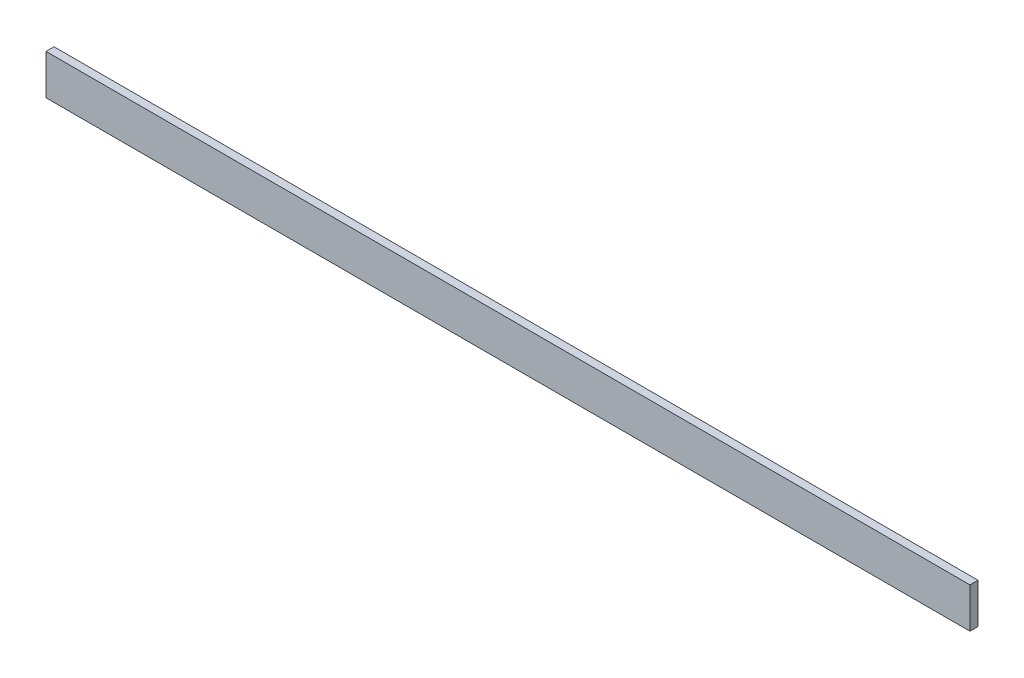
ISO-10303-21;
HEADER;
FILE_DESCRIPTION(('STEP AP214'),'2;1');
FILE_NAME('part.step','',(''),(''),'','','');
FILE_SCHEMA(('AUTOMOTIVE_DESIGN { 1 0 10303 214 1 1 1 1 }'));
ENDSEC;
DATA;
#1=APPLICATION_CONTEXT('core data for automotive mechanical design processes');
#2=APPLICATION_PROTOCOL_DEFINITION('international standard','automotive_design',2000,#1);
#3=PRODUCT_CONTEXT('',#1,'mechanical');
#4=PRODUCT('Part','Part','',(#3));
#5=PRODUCT_RELATED_PRODUCT_CATEGORY('part','',(#4));
#6=PRODUCT_DEFINITION_FORMATION('','',#4);
#7=PRODUCT_DEFINITION_CONTEXT('part definition',#1,'design');
#8=PRODUCT_DEFINITION('design','',#6,#7);
#9=PRODUCT_DEFINITION_SHAPE('','',#8);
#10=(LENGTH_UNIT() NAMED_UNIT(*) SI_UNIT(.MILLI.,.METRE.));
#11=(NAMED_UNIT(*) PLANE_ANGLE_UNIT() SI_UNIT($,.RADIAN.));
#12=(NAMED_UNIT(*) SI_UNIT($,.STERADIAN.) SOLID_ANGLE_UNIT());
#13=UNCERTAINTY_MEASURE_WITH_UNIT(LENGTH_MEASURE(1.E-05),#10,'distance_accuracy_value','');
#14=(GEOMETRIC_REPRESENTATION_CONTEXT(3) GLOBAL_UNCERTAINTY_ASSIGNED_CONTEXT((#13)) GLOBAL_UNIT_ASSIGNED_CONTEXT((#10,
#11,#12)) REPRESENTATION_CONTEXT('',''));
#15=CARTESIAN_POINT('',(0.,0.,0.));
#16=DIRECTION('',(0.,0.,1.));
#17=DIRECTION('',(1.,0.,0.));
#18=AXIS2_PLACEMENT_3D('',#15,#16,#17);
#19=CARTESIAN_POINT('',(0.,0.,20.));
#20=DIRECTION('',(1.,0.,0.));
#21=DIRECTION('',(0.,0.,-1.));
#22=AXIS2_PLACEMENT_3D('',#19,#20,#21);
#23=PLANE('',#22);
#24=DIRECTION('',(0.,-1.,0.));
#25=VECTOR('',#24,1.);
#26=CARTESIAN_POINT('',(0.,0.,0.));
#27=LINE('',#26,#25);
#28=CARTESIAN_POINT('',(0.,100.,0.));
#29=VERTEX_POINT('',#28);
#30=CARTESIAN_POINT('',(0.,0.,0.));
#31=VERTEX_POINT('',#30);
#32=EDGE_CURVE('E107',#29,#31,#27,.T.);
#33=ORIENTED_EDGE('',*,*,#32,.T.);
#34=DIRECTION('',(0.,0.,-1.));
#35=VECTOR('',#34,1.);
#36=CARTESIAN_POINT('',(0.,0.,20.));
#37=LINE('',#36,#35);
#38=CARTESIAN_POINT('',(0.,0.,20.));
#39=VERTEX_POINT('',#38);
#40=EDGE_CURVE('E11',#39,#31,#37,.T.);
#41=ORIENTED_EDGE('',*,*,#40,.F.);
#42=DIRECTION('',(0.,-1.,0.));
#43=VECTOR('',#42,1.);
#44=CARTESIAN_POINT('',(0.,0.,20.));
#45=LINE('',#44,#43);
#46=CARTESIAN_POINT('',(0.,100.,20.));
#47=VERTEX_POINT('',#46);
#48=EDGE_CURVE('E91',#47,#39,#45,.T.);
#49=ORIENTED_EDGE('',*,*,#48,.F.);
#50=DIRECTION('',(0.,0.,-1.));
#51=VECTOR('',#50,1.);
#52=CARTESIAN_POINT('',(0.,100.,20.));
#53=LINE('',#52,#51);
#54=EDGE_CURVE('E103',#47,#29,#53,.T.);
#55=ORIENTED_EDGE('',*,*,#54,.T.);
#56=EDGE_LOOP('',(#33,#41,#49,#55));
#57=FACE_BOUND('',#56,.T.);
#58=ADVANCED_FACE('F39',(#57),#23,.F.);
#59=CARTESIAN_POINT('',(0.,0.,20.));
#60=DIRECTION('',(0.,1.,0.));
#61=DIRECTION('',(0.,0.,1.));
#62=AXIS2_PLACEMENT_3D('',#59,#60,#61);
#63=PLANE('',#62);
#64=DIRECTION('',(1.,0.,0.));
#65=VECTOR('',#64,1.);
#66=CARTESIAN_POINT('',(0.,0.,0.));
#67=LINE('',#66,#65);
#68=CARTESIAN_POINT('',(2300.,0.,0.));
#69=VERTEX_POINT('',#68);
#70=EDGE_CURVE('E96',#31,#69,#67,.T.);
#71=ORIENTED_EDGE('',*,*,#70,.T.);
#72=DIRECTION('',(0.,0.,-1.));
#73=VECTOR('',#72,1.);
#74=CARTESIAN_POINT('',(2300.,0.,20.));
#75=LINE('',#74,#73);
#76=CARTESIAN_POINT('',(2300.,0.,20.));
#77=VERTEX_POINT('',#76);
#78=EDGE_CURVE('E48',#77,#69,#75,.T.);
#79=ORIENTED_EDGE('',*,*,#78,.F.);
#80=DIRECTION('',(1.,0.,0.));
#81=VECTOR('',#80,1.);
#82=CARTESIAN_POINT('',(0.,0.,20.));
#83=LINE('',#82,#81);
#84=EDGE_CURVE('E86',#39,#77,#83,.T.);
#85=ORIENTED_EDGE('',*,*,#84,.F.);
#86=ORIENTED_EDGE('',*,*,#40,.T.);
#87=EDGE_LOOP('',(#71,#79,#85,#86));
#88=FACE_BOUND('',#87,.T.);
#89=ADVANCED_FACE('F95',(#88),#63,.F.);
#90=CARTESIAN_POINT('',(2300.,0.,20.));
#91=DIRECTION('',(-1.,0.,0.));
#92=DIRECTION('',(0.,0.,1.));
#93=AXIS2_PLACEMENT_3D('',#90,#91,#92);
#94=PLANE('',#93);
#95=DIRECTION('',(0.,1.,0.));
#96=VECTOR('',#95,1.);
#97=CARTESIAN_POINT('',(2300.,0.,0.));
#98=LINE('',#97,#96);
#99=CARTESIAN_POINT('',(2300.,100.,0.));
#100=VERTEX_POINT('',#99);
#101=EDGE_CURVE('E73',#69,#100,#98,.T.);
#102=ORIENTED_EDGE('',*,*,#101,.T.);
#103=DIRECTION('',(0.,0.,-1.));
#104=VECTOR('',#103,1.);
#105=CARTESIAN_POINT('',(2300.,100.,20.));
#106=LINE('',#105,#104);
#107=CARTESIAN_POINT('',(2300.,100.,20.));
#108=VERTEX_POINT('',#107);
#109=EDGE_CURVE('E98',#108,#100,#106,.T.);
#110=ORIENTED_EDGE('',*,*,#109,.F.);
#111=DIRECTION('',(0.,1.,0.));
#112=VECTOR('',#111,1.);
#113=CARTESIAN_POINT('',(2300.,0.,20.));
#114=LINE('',#113,#112);
#115=EDGE_CURVE('E89',#77,#108,#114,.T.);
#116=ORIENTED_EDGE('',*,*,#115,.F.);
#117=ORIENTED_EDGE('',*,*,#78,.T.);
#118=EDGE_LOOP('',(#102,#110,#116,#117));
#119=FACE_BOUND('',#118,.T.);
#120=ADVANCED_FACE('F99',(#119),#94,.F.);
#121=CARTESIAN_POINT('',(0.,100.,20.));
#122=DIRECTION('',(0.,-1.,0.));
#123=DIRECTION('',(0.,0.,-1.));
#124=AXIS2_PLACEMENT_3D('',#121,#122,#123);
#125=PLANE('',#124);
#126=DIRECTION('',(-1.,0.,0.));
#127=VECTOR('',#126,1.);
#128=CARTESIAN_POINT('',(0.,100.,0.));
#129=LINE('',#128,#127);
#130=EDGE_CURVE('E79',#100,#29,#129,.T.);
#131=ORIENTED_EDGE('',*,*,#130,.T.);
#132=ORIENTED_EDGE('',*,*,#54,.F.);
#133=DIRECTION('',(-1.,0.,0.));
#134=VECTOR('',#133,1.);
#135=CARTESIAN_POINT('',(0.,100.,20.));
#136=LINE('',#135,#134);
#137=EDGE_CURVE('E56',#108,#47,#136,.T.);
#138=ORIENTED_EDGE('',*,*,#137,.F.);
#139=ORIENTED_EDGE('',*,*,#109,.T.);
#140=EDGE_LOOP('',(#131,#132,#138,#139));
#141=FACE_BOUND('',#140,.T.);
#142=ADVANCED_FACE('F120',(#141),#125,.F.);
#143=CARTESIAN_POINT('',(0.,0.,20.));
#144=DIRECTION('',(0.,0.,-1.));
#145=DIRECTION('',(-1.,0.,0.));
#146=AXIS2_PLACEMENT_3D('',#143,#144,#145);
#147=PLANE('',#146);
#148=ORIENTED_EDGE('',*,*,#48,.T.);
#149=ORIENTED_EDGE('',*,*,#84,.T.);
#150=ORIENTED_EDGE('',*,*,#115,.T.);
#151=ORIENTED_EDGE('',*,*,#137,.T.);
#152=EDGE_LOOP('',(#148,#149,#150,#151));
#153=FACE_BOUND('',#152,.T.);
#154=ADVANCED_FACE('F87',(#153),#147,.F.);
#155=CARTESIAN_POINT('',(0.,0.,0.));
#156=DIRECTION('',(0.,0.,-1.));
#157=DIRECTION('',(-1.,0.,0.));
#158=AXIS2_PLACEMENT_3D('',#155,#156,#157);
#159=PLANE('',#158);
#160=ORIENTED_EDGE('',*,*,#32,.F.);
#161=ORIENTED_EDGE('',*,*,#130,.F.);
#162=ORIENTED_EDGE('',*,*,#101,.F.);
#163=ORIENTED_EDGE('',*,*,#70,.F.);
#164=EDGE_LOOP('',(#160,#161,#162,#163));
#165=FACE_BOUND('',#164,.T.);
#166=ADVANCED_FACE('F123',(#165),#159,.T.);
#167=CLOSED_SHELL('',(#58,#89,#120,#142,#154,#166));
#168=MANIFOLD_SOLID_BREP('B2',#167);
#169=ADVANCED_BREP_SHAPE_REPRESENTATION('',(#18,#168),#14);
#170=SHAPE_DEFINITION_REPRESENTATION(#9,#169);
ENDSEC;
END-ISO-10303-21;
